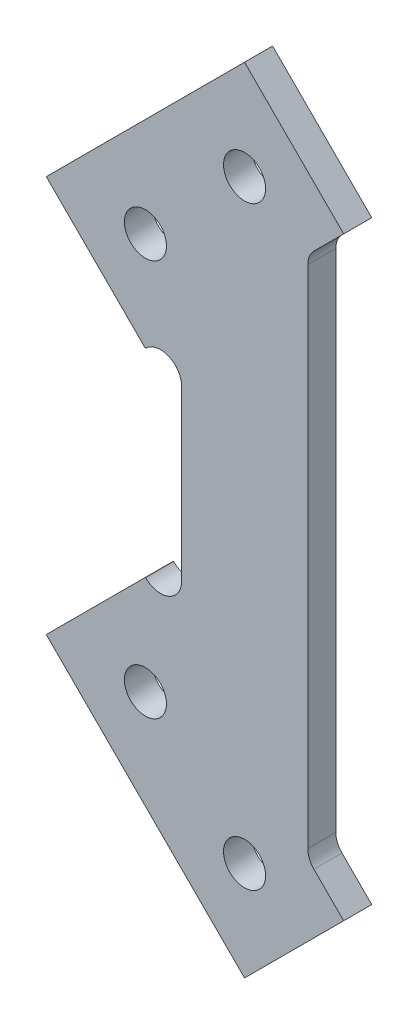
ISO-10303-21;
HEADER;
FILE_DESCRIPTION(('STEP AP214'),'2;1');
FILE_NAME('part.step','',(''),(''),'','','');
FILE_SCHEMA(('AUTOMOTIVE_DESIGN { 1 0 10303 214 1 1 1 1 }'));
ENDSEC;
DATA;
#1=APPLICATION_CONTEXT('core data for automotive mechanical design processes');
#2=APPLICATION_PROTOCOL_DEFINITION('international standard','automotive_design',2000,#1);
#3=PRODUCT_CONTEXT('',#1,'mechanical');
#4=PRODUCT('Part','Part','',(#3));
#5=PRODUCT_RELATED_PRODUCT_CATEGORY('part','',(#4));
#6=PRODUCT_DEFINITION_FORMATION('','',#4);
#7=PRODUCT_DEFINITION_CONTEXT('part definition',#1,'design');
#8=PRODUCT_DEFINITION('design','',#6,#7);
#9=PRODUCT_DEFINITION_SHAPE('','',#8);
#10=(LENGTH_UNIT() NAMED_UNIT(*) SI_UNIT(.MILLI.,.METRE.));
#11=(NAMED_UNIT(*) PLANE_ANGLE_UNIT() SI_UNIT($,.RADIAN.));
#12=(NAMED_UNIT(*) SI_UNIT($,.STERADIAN.) SOLID_ANGLE_UNIT());
#13=UNCERTAINTY_MEASURE_WITH_UNIT(LENGTH_MEASURE(1.E-05),#10,'distance_accuracy_value','');
#14=(GEOMETRIC_REPRESENTATION_CONTEXT(3) GLOBAL_UNCERTAINTY_ASSIGNED_CONTEXT((#13)) GLOBAL_UNIT_ASSIGNED_CONTEXT((#10,
#11,#12)) REPRESENTATION_CONTEXT('',''));
#15=CARTESIAN_POINT('',(0.,0.,0.));
#16=DIRECTION('',(0.,0.,1.));
#17=DIRECTION('',(1.,0.,0.));
#18=AXIS2_PLACEMENT_3D('',#15,#16,#17);
#19=CARTESIAN_POINT('',(-12.0000000000007,12.0624458405147,4.));
#20=DIRECTION('',(0.,0.,1.));
#21=DIRECTION('',(1.,0.,0.));
#22=AXIS2_PLACEMENT_3D('',#19,#20,#21);
#23=PLANE('',#22);
#24=CARTESIAN_POINT('',(-14.1629509039037,-28.2842712474611,4.));
#25=DIRECTION('',(0.,0.,1.));
#26=DIRECTION('',(1.,0.,0.));
#27=AXIS2_PLACEMENT_3D('',#24,#25,#26);
#28=CIRCLE('',#27,3.00000000000029);
#29=CARTESIAN_POINT('',(-11.1629509039034,-28.2842712474611,4.));
#30=VERTEX_POINT('',#29);
#31=EDGE_CURVE('E343',#30,#30,#28,.T.);
#32=ORIENTED_EDGE('',*,*,#31,.F.);
#33=EDGE_LOOP('',(#32));
#34=FACE_BOUND('',#33,.T.);
#35=CARTESIAN_POINT('',(-0.0208152801727197,42.4264068711936,4.));
#36=DIRECTION('',(0.,0.,1.));
#37=DIRECTION('',(1.,0.,0.));
#38=AXIS2_PLACEMENT_3D('',#35,#36,#37);
#39=CIRCLE('',#38,2.99999999999871);
#40=CARTESIAN_POINT('',(2.97918471982599,42.4264068711936,4.));
#41=VERTEX_POINT('',#40);
#42=EDGE_CURVE('E181',#41,#41,#39,.T.);
#43=ORIENTED_EDGE('',*,*,#42,.F.);
#44=EDGE_LOOP('',(#43));
#45=FACE_BOUND('',#44,.T.);
#46=DIRECTION('',(0.707106781186546,-0.707106781186549,0.));
#47=VECTOR('',#46,1.);
#48=CARTESIAN_POINT('',(-28.3050865276346,28.2842712474627,4.));
#49=LINE('',#48,#47);
#50=CARTESIAN_POINT('',(-28.3050865276346,28.2842712474627,4.));
#51=VERTEX_POINT('',#50);
#52=CARTESIAN_POINT('',(-14.1629509039037,14.1421356237317,4.));
#53=VERTEX_POINT('',#52);
#54=EDGE_CURVE('E208',#51,#53,#49,.T.);
#55=ORIENTED_EDGE('',*,*,#54,.T.);
#56=DIRECTION('',(0.7071067811864,0.707106781186695,0.));
#57=VECTOR('',#56,1.);
#58=CARTESIAN_POINT('',(-14.1629509039037,14.1421356237317,4.));
#59=LINE('',#58,#57);
#60=CARTESIAN_POINT('',(-14.1213203435611,14.1837661840744,4.));
#61=VERTEX_POINT('',#60);
#62=EDGE_CURVE('E116',#53,#61,#59,.T.);
#63=ORIENTED_EDGE('',*,*,#62,.T.);
#64=CARTESIAN_POINT('',(-12.0000000000007,12.0624458405147,4.));
#65=DIRECTION('',(0.,0.,-1.));
#66=DIRECTION('',(1.,0.,0.));
#67=AXIS2_PLACEMENT_3D('',#64,#65,#66);
#68=CIRCLE('',#67,2.99999999999989);
#69=CARTESIAN_POINT('',(-9.00000000000085,12.0624458405147,4.));
#70=VERTEX_POINT('',#69);
#71=EDGE_CURVE('E247',#61,#70,#68,.T.);
#72=ORIENTED_EDGE('',*,*,#71,.T.);
#73=DIRECTION('',(0.,-1.,0.));
#74=VECTOR('',#73,1.);
#75=CARTESIAN_POINT('',(-9.00000000000148,12.0624458405147,4.));
#76=LINE('',#75,#74);
#77=CARTESIAN_POINT('',(-9.00000000000075,-12.0624458405131,4.));
#78=VERTEX_POINT('',#77);
#79=EDGE_CURVE('E266',#70,#78,#76,.T.);
#80=ORIENTED_EDGE('',*,*,#79,.T.);
#81=CARTESIAN_POINT('',(-12.0000000000008,-12.0624458405131,4.));
#82=DIRECTION('',(0.,0.,-1.));
#83=DIRECTION('',(-1.,0.,0.));
#84=AXIS2_PLACEMENT_3D('',#81,#82,#83);
#85=CIRCLE('',#84,3.);
#86=CARTESIAN_POINT('',(-14.1213203435604,-14.1837661840727,4.));
#87=VERTEX_POINT('',#86);
#88=EDGE_CURVE('E263',#78,#87,#85,.T.);
#89=ORIENTED_EDGE('',*,*,#88,.T.);
#90=DIRECTION('',(-0.707106781186459,0.707106781186636,0.));
#91=VECTOR('',#90,1.);
#92=CARTESIAN_POINT('',(-14.162950903903,-14.1421356237301,4.));
#93=LINE('',#92,#91);
#94=CARTESIAN_POINT('',(-14.162950903903,-14.1421356237301,4.));
#95=VERTEX_POINT('',#94);
#96=EDGE_CURVE('E265',#87,#95,#93,.T.);
#97=ORIENTED_EDGE('',*,*,#96,.T.);
#98=DIRECTION('',(-0.707106781186568,-0.707106781186527,0.));
#99=VECTOR('',#98,1.);
#100=CARTESIAN_POINT('',(-28.3050865276346,-28.284271247461,4.));
#101=LINE('',#100,#99);
#102=CARTESIAN_POINT('',(-28.3050865276346,-28.284271247461,4.));
#103=VERTEX_POINT('',#102);
#104=EDGE_CURVE('E268',#95,#103,#101,.T.);
#105=ORIENTED_EDGE('',*,*,#104,.T.);
#106=DIRECTION('',(0.707106781186546,-0.707106781186549,0.));
#107=VECTOR('',#106,1.);
#108=CARTESIAN_POINT('',(-0.0208152801728197,-56.568542494923,4.));
#109=LINE('',#108,#107);
#110=CARTESIAN_POINT('',(-0.0208152801728197,-56.568542494923,4.));
#111=VERTEX_POINT('',#110);
#112=EDGE_CURVE('E274',#103,#111,#109,.T.);
#113=ORIENTED_EDGE('',*,*,#112,.T.);
#114=DIRECTION('',(0.707106781186549,0.707106781186546,0.));
#115=VECTOR('',#114,1.);
#116=CARTESIAN_POINT('',(14.1213203435582,-42.4264068711921,4.));
#117=LINE('',#116,#115);
#118=CARTESIAN_POINT('',(14.1213203435582,-42.4264068711921,4.));
#119=VERTEX_POINT('',#118);
#120=EDGE_CURVE('E276',#111,#119,#117,.T.);
#121=ORIENTED_EDGE('',*,*,#120,.T.);
#122=DIRECTION('',(-0.707106781186547,0.707106781186549,0.));
#123=VECTOR('',#122,1.);
#124=CARTESIAN_POINT('',(9.87867965643887,-38.1837661840728,4.));
#125=LINE('',#124,#123);
#126=CARTESIAN_POINT('',(9.87867965643887,-38.1837661840728,4.));
#127=VERTEX_POINT('',#126);
#128=EDGE_CURVE('E278',#119,#127,#125,.T.);
#129=ORIENTED_EDGE('',*,*,#128,.T.);
#130=CARTESIAN_POINT('',(11.9999999999993,-36.0624458405132,4.));
#131=DIRECTION('',(0.,0.,-1.));
#132=DIRECTION('',(1.,0.,0.));
#133=AXIS2_PLACEMENT_3D('',#130,#131,#132);
#134=CIRCLE('',#133,3.00000000000061);
#135=CARTESIAN_POINT('',(8.99999999999864,-36.0624458405131,4.));
#136=VERTEX_POINT('',#135);
#137=EDGE_CURVE('E280',#127,#136,#134,.T.);
#138=ORIENTED_EDGE('',*,*,#137,.T.);
#139=DIRECTION('',(0.,1.,0.));
#140=VECTOR('',#139,1.);
#141=CARTESIAN_POINT('',(8.99999999999851,36.0624458405146,4.));
#142=LINE('',#141,#140);
#143=CARTESIAN_POINT('',(8.99999999999851,36.0624458405146,4.));
#144=VERTEX_POINT('',#143);
#145=EDGE_CURVE('E282',#136,#144,#142,.T.);
#146=ORIENTED_EDGE('',*,*,#145,.T.);
#147=CARTESIAN_POINT('',(11.9999999999992,36.0624458405146,4.));
#148=DIRECTION('',(0.,0.,-1.));
#149=DIRECTION('',(1.,0.,0.));
#150=AXIS2_PLACEMENT_3D('',#147,#148,#149);
#151=CIRCLE('',#150,3.00000000000063);
#152=CARTESIAN_POINT('',(9.8786796564388,38.1837661840743,4.));
#153=VERTEX_POINT('',#152);
#154=EDGE_CURVE('E159',#144,#153,#151,.T.);
#155=ORIENTED_EDGE('',*,*,#154,.T.);
#156=DIRECTION('',(0.70710678118655,0.707106781186545,0.));
#157=VECTOR('',#156,1.);
#158=CARTESIAN_POINT('',(9.87867965643887,38.1837661840742,4.));
#159=LINE('',#158,#157);
#160=CARTESIAN_POINT('',(14.1213203435577,42.426406871193,4.));
#161=VERTEX_POINT('',#160);
#162=EDGE_CURVE('E153',#153,#161,#159,.T.);
#163=ORIENTED_EDGE('',*,*,#162,.T.);
#164=DIRECTION('',(-0.707106781186518,0.707106781186576,0.));
#165=VECTOR('',#164,1.);
#166=CARTESIAN_POINT('',(14.1213203435577,42.426406871193,4.));
#167=LINE('',#166,#165);
#168=CARTESIAN_POINT('',(-0.0208152801726905,56.5685424949245,4.));
#169=VERTEX_POINT('',#168);
#170=EDGE_CURVE('E157',#161,#169,#167,.T.);
#171=ORIENTED_EDGE('',*,*,#170,.T.);
#172=DIRECTION('',(-0.707106781186549,-0.707106781186546,0.));
#173=VECTOR('',#172,1.);
#174=CARTESIAN_POINT('',(-0.0208152801726905,56.5685424949245,4.));
#175=LINE('',#174,#173);
#176=EDGE_CURVE('E49',#169,#51,#175,.T.);
#177=ORIENTED_EDGE('',*,*,#176,.T.);
#178=EDGE_LOOP('',(#55,#63,#72,#80,#89,#97,#105,#113,#121,#129,#138,#146,#155,#163,#171,#177));
#179=FACE_BOUND('',#178,.T.);
#180=CARTESIAN_POINT('',(-14.1629509039037,28.2842712474627,4.));
#181=DIRECTION('',(0.,0.,1.));
#182=DIRECTION('',(1.,0.,0.));
#183=AXIS2_PLACEMENT_3D('',#180,#181,#182);
#184=CIRCLE('',#183,2.99999999999871);
#185=CARTESIAN_POINT('',(-11.162950903905,28.2842712474627,4.));
#186=VERTEX_POINT('',#185);
#187=EDGE_CURVE('E349',#186,#186,#184,.T.);
#188=ORIENTED_EDGE('',*,*,#187,.F.);
#189=EDGE_LOOP('',(#188));
#190=FACE_BOUND('',#189,.T.);
#191=CARTESIAN_POINT('',(-0.0208152801727912,-42.426406871192,4.));
#192=DIRECTION('',(0.,0.,1.));
#193=DIRECTION('',(1.,0.,0.));
#194=AXIS2_PLACEMENT_3D('',#191,#192,#193);
#195=CIRCLE('',#194,3.0000000000003);
#196=CARTESIAN_POINT('',(2.97918471982751,-42.426406871192,4.));
#197=VERTEX_POINT('',#196);
#198=EDGE_CURVE('E334',#197,#197,#195,.T.);
#199=ORIENTED_EDGE('',*,*,#198,.F.);
#200=EDGE_LOOP('',(#199));
#201=FACE_BOUND('',#200,.T.);
#202=ADVANCED_FACE('F32',(#34,#45,#179,#190,#201),#23,.T.);
#203=CARTESIAN_POINT('',(-12.0000000000007,12.0624458405147,0.));
#204=DIRECTION('',(0.,0.,1.));
#205=DIRECTION('',(1.,0.,0.));
#206=AXIS2_PLACEMENT_3D('',#203,#204,#205);
#207=PLANE('',#206);
#208=CARTESIAN_POINT('',(-14.1629509039037,-28.2842712474611,0.));
#209=DIRECTION('',(0.,0.,1.));
#210=DIRECTION('',(1.,0.,0.));
#211=AXIS2_PLACEMENT_3D('',#208,#209,#210);
#212=CIRCLE('',#211,3.00000000000029);
#213=CARTESIAN_POINT('',(-11.1629509039034,-28.2842712474611,0.));
#214=VERTEX_POINT('',#213);
#215=EDGE_CURVE('E340',#214,#214,#212,.T.);
#216=ORIENTED_EDGE('',*,*,#215,.T.);
#217=EDGE_LOOP('',(#216));
#218=FACE_BOUND('',#217,.T.);
#219=CARTESIAN_POINT('',(-0.0208152801727197,42.4264068711936,0.));
#220=DIRECTION('',(0.,0.,1.));
#221=DIRECTION('',(1.,0.,0.));
#222=AXIS2_PLACEMENT_3D('',#219,#220,#221);
#223=CIRCLE('',#222,2.99999999999871);
#224=CARTESIAN_POINT('',(2.97918471982599,42.4264068711936,0.));
#225=VERTEX_POINT('',#224);
#226=EDGE_CURVE('E352',#225,#225,#223,.T.);
#227=ORIENTED_EDGE('',*,*,#226,.T.);
#228=EDGE_LOOP('',(#227));
#229=FACE_BOUND('',#228,.T.);
#230=DIRECTION('',(0.707106781186546,-0.707106781186549,0.));
#231=VECTOR('',#230,1.);
#232=CARTESIAN_POINT('',(-28.3050865276346,28.2842712474627,0.));
#233=LINE('',#232,#231);
#234=CARTESIAN_POINT('',(-28.3050865276346,28.2842712474627,0.));
#235=VERTEX_POINT('',#234);
#236=CARTESIAN_POINT('',(-14.1629509039037,14.1421356237317,0.));
#237=VERTEX_POINT('',#236);
#238=EDGE_CURVE('E177',#235,#237,#233,.T.);
#239=ORIENTED_EDGE('',*,*,#238,.F.);
#240=DIRECTION('',(-0.707106781186549,-0.707106781186546,0.));
#241=VECTOR('',#240,1.);
#242=CARTESIAN_POINT('',(-0.0208152801726905,56.5685424949245,0.));
#243=LINE('',#242,#241);
#244=CARTESIAN_POINT('',(-0.0208152801726905,56.5685424949245,0.));
#245=VERTEX_POINT('',#244);
#246=EDGE_CURVE('E108',#245,#235,#243,.T.);
#247=ORIENTED_EDGE('',*,*,#246,.F.);
#248=DIRECTION('',(-0.707106781186518,0.707106781186576,0.));
#249=VECTOR('',#248,1.);
#250=CARTESIAN_POINT('',(14.1213203435577,42.426406871193,0.));
#251=LINE('',#250,#249);
#252=CARTESIAN_POINT('',(14.1213203435577,42.426406871193,0.));
#253=VERTEX_POINT('',#252);
#254=EDGE_CURVE('E102',#253,#245,#251,.T.);
#255=ORIENTED_EDGE('',*,*,#254,.F.);
#256=DIRECTION('',(0.70710678118655,0.707106781186545,0.));
#257=VECTOR('',#256,1.);
#258=CARTESIAN_POINT('',(9.87867965643887,38.1837661840742,0.));
#259=LINE('',#258,#257);
#260=CARTESIAN_POINT('',(9.8786796564388,38.1837661840743,0.));
#261=VERTEX_POINT('',#260);
#262=EDGE_CURVE('E167',#261,#253,#259,.T.);
#263=ORIENTED_EDGE('',*,*,#262,.F.);
#264=CARTESIAN_POINT('',(11.9999999999992,36.0624458405146,0.));
#265=DIRECTION('',(0.,0.,-1.));
#266=DIRECTION('',(1.,0.,0.));
#267=AXIS2_PLACEMENT_3D('',#264,#265,#266);
#268=CIRCLE('',#267,3.00000000000063);
#269=CARTESIAN_POINT('',(8.99999999999851,36.0624458405146,0.));
#270=VERTEX_POINT('',#269);
#271=EDGE_CURVE('E203',#270,#261,#268,.T.);
#272=ORIENTED_EDGE('',*,*,#271,.F.);
#273=DIRECTION('',(0.,1.,0.));
#274=VECTOR('',#273,1.);
#275=CARTESIAN_POINT('',(8.99999999999851,36.0624458405146,0.));
#276=LINE('',#275,#274);
#277=CARTESIAN_POINT('',(8.99999999999864,-36.0624458405131,0.));
#278=VERTEX_POINT('',#277);
#279=EDGE_CURVE('E201',#278,#270,#276,.T.);
#280=ORIENTED_EDGE('',*,*,#279,.F.);
#281=CARTESIAN_POINT('',(11.9999999999993,-36.0624458405132,0.));
#282=DIRECTION('',(0.,0.,-1.));
#283=DIRECTION('',(1.,0.,0.));
#284=AXIS2_PLACEMENT_3D('',#281,#282,#283);
#285=CIRCLE('',#284,3.00000000000061);
#286=CARTESIAN_POINT('',(9.87867965643887,-38.1837661840728,0.));
#287=VERTEX_POINT('',#286);
#288=EDGE_CURVE('E199',#287,#278,#285,.T.);
#289=ORIENTED_EDGE('',*,*,#288,.F.);
#290=DIRECTION('',(-0.707106781186547,0.707106781186549,0.));
#291=VECTOR('',#290,1.);
#292=CARTESIAN_POINT('',(9.87867965643887,-38.1837661840728,0.));
#293=LINE('',#292,#291);
#294=CARTESIAN_POINT('',(14.1213203435582,-42.4264068711921,0.));
#295=VERTEX_POINT('',#294);
#296=EDGE_CURVE('E197',#295,#287,#293,.T.);
#297=ORIENTED_EDGE('',*,*,#296,.F.);
#298=DIRECTION('',(0.707106781186549,0.707106781186546,0.));
#299=VECTOR('',#298,1.);
#300=CARTESIAN_POINT('',(14.1213203435582,-42.4264068711921,0.));
#301=LINE('',#300,#299);
#302=CARTESIAN_POINT('',(-0.0208152801728197,-56.568542494923,0.));
#303=VERTEX_POINT('',#302);
#304=EDGE_CURVE('E195',#303,#295,#301,.T.);
#305=ORIENTED_EDGE('',*,*,#304,.F.);
#306=DIRECTION('',(0.707106781186546,-0.707106781186549,0.));
#307=VECTOR('',#306,1.);
#308=CARTESIAN_POINT('',(-0.0208152801728197,-56.568542494923,0.));
#309=LINE('',#308,#307);
#310=CARTESIAN_POINT('',(-28.3050865276346,-28.284271247461,0.));
#311=VERTEX_POINT('',#310);
#312=EDGE_CURVE('E193',#311,#303,#309,.T.);
#313=ORIENTED_EDGE('',*,*,#312,.F.);
#314=DIRECTION('',(-0.707106781186568,-0.707106781186527,0.));
#315=VECTOR('',#314,1.);
#316=CARTESIAN_POINT('',(-28.3050865276346,-28.284271247461,0.));
#317=LINE('',#316,#315);
#318=CARTESIAN_POINT('',(-14.162950903903,-14.1421356237301,0.));
#319=VERTEX_POINT('',#318);
#320=EDGE_CURVE('E191',#319,#311,#317,.T.);
#321=ORIENTED_EDGE('',*,*,#320,.F.);
#322=DIRECTION('',(-0.707106781186459,0.707106781186636,0.));
#323=VECTOR('',#322,1.);
#324=CARTESIAN_POINT('',(-14.162950903903,-14.1421356237301,0.));
#325=LINE('',#324,#323);
#326=CARTESIAN_POINT('',(-14.1213203435604,-14.1837661840727,0.));
#327=VERTEX_POINT('',#326);
#328=EDGE_CURVE('E189',#327,#319,#325,.T.);
#329=ORIENTED_EDGE('',*,*,#328,.F.);
#330=CARTESIAN_POINT('',(-12.0000000000008,-12.0624458405131,0.));
#331=DIRECTION('',(0.,0.,-1.));
#332=DIRECTION('',(-1.,0.,0.));
#333=AXIS2_PLACEMENT_3D('',#330,#331,#332);
#334=CIRCLE('',#333,3.);
#335=CARTESIAN_POINT('',(-9.00000000000075,-12.0624458405131,0.));
#336=VERTEX_POINT('',#335);
#337=EDGE_CURVE('E187',#336,#327,#334,.T.);
#338=ORIENTED_EDGE('',*,*,#337,.F.);
#339=DIRECTION('',(0.,-1.,0.));
#340=VECTOR('',#339,1.);
#341=CARTESIAN_POINT('',(-9.00000000000148,12.0624458405147,0.));
#342=LINE('',#341,#340);
#343=CARTESIAN_POINT('',(-9.00000000000085,12.0624458405147,0.));
#344=VERTEX_POINT('',#343);
#345=EDGE_CURVE('E185',#344,#336,#342,.T.);
#346=ORIENTED_EDGE('',*,*,#345,.F.);
#347=CARTESIAN_POINT('',(-12.0000000000007,12.0624458405147,0.));
#348=DIRECTION('',(0.,0.,-1.));
#349=DIRECTION('',(1.,0.,0.));
#350=AXIS2_PLACEMENT_3D('',#347,#348,#349);
#351=CIRCLE('',#350,2.99999999999989);
#352=CARTESIAN_POINT('',(-14.1213203435611,14.1837661840744,0.));
#353=VERTEX_POINT('',#352);
#354=EDGE_CURVE('E183',#353,#344,#351,.T.);
#355=ORIENTED_EDGE('',*,*,#354,.F.);
#356=DIRECTION('',(0.7071067811864,0.707106781186695,0.));
#357=VECTOR('',#356,1.);
#358=CARTESIAN_POINT('',(-14.1629509039037,14.1421356237317,0.));
#359=LINE('',#358,#357);
#360=EDGE_CURVE('E180',#237,#353,#359,.T.);
#361=ORIENTED_EDGE('',*,*,#360,.F.);
#362=EDGE_LOOP('',(#239,#247,#255,#263,#272,#280,#289,#297,#305,#313,#321,#329,#338,#346,#355,#361));
#363=FACE_BOUND('',#362,.T.);
#364=CARTESIAN_POINT('',(-14.1629509039037,28.2842712474627,0.));
#365=DIRECTION('',(0.,0.,1.));
#366=DIRECTION('',(1.,0.,0.));
#367=AXIS2_PLACEMENT_3D('',#364,#365,#366);
#368=CIRCLE('',#367,2.99999999999871);
#369=CARTESIAN_POINT('',(-11.162950903905,28.2842712474627,0.));
#370=VERTEX_POINT('',#369);
#371=EDGE_CURVE('E346',#370,#370,#368,.T.);
#372=ORIENTED_EDGE('',*,*,#371,.T.);
#373=EDGE_LOOP('',(#372));
#374=FACE_BOUND('',#373,.T.);
#375=CARTESIAN_POINT('',(-0.0208152801727912,-42.426406871192,0.));
#376=DIRECTION('',(0.,0.,1.));
#377=DIRECTION('',(1.,0.,0.));
#378=AXIS2_PLACEMENT_3D('',#375,#376,#377);
#379=CIRCLE('',#378,3.0000000000003);
#380=CARTESIAN_POINT('',(2.97918471982751,-42.426406871192,0.));
#381=VERTEX_POINT('',#380);
#382=EDGE_CURVE('E337',#381,#381,#379,.T.);
#383=ORIENTED_EDGE('',*,*,#382,.T.);
#384=EDGE_LOOP('',(#383));
#385=FACE_BOUND('',#384,.T.);
#386=ADVANCED_FACE('F251',(#218,#229,#363,#374,#385),#207,.F.);
#387=CARTESIAN_POINT('',(-28.3050865276346,28.2842712474627,4.));
#388=DIRECTION('',(0.707106781186549,0.707106781186546,0.));
#389=DIRECTION('',(-0.707106781186546,0.707106781186549,0.));
#390=AXIS2_PLACEMENT_3D('',#387,#388,#389);
#391=PLANE('',#390);
#392=ORIENTED_EDGE('',*,*,#238,.T.);
#393=DIRECTION('',(0.,0.,-1.));
#394=VECTOR('',#393,1.);
#395=CARTESIAN_POINT('',(-14.1629509039037,14.1421356237317,4.));
#396=LINE('',#395,#394);
#397=EDGE_CURVE('E11',#53,#237,#396,.T.);
#398=ORIENTED_EDGE('',*,*,#397,.F.);
#399=ORIENTED_EDGE('',*,*,#54,.F.);
#400=DIRECTION('',(0.,0.,-1.));
#401=VECTOR('',#400,1.);
#402=CARTESIAN_POINT('',(-28.3050865276346,28.2842712474627,4.));
#403=LINE('',#402,#401);
#404=EDGE_CURVE('E173',#51,#235,#403,.T.);
#405=ORIENTED_EDGE('',*,*,#404,.T.);
#406=EDGE_LOOP('',(#392,#398,#399,#405));
#407=FACE_BOUND('',#406,.T.);
#408=ADVANCED_FACE('F34',(#407),#391,.F.);
#409=CARTESIAN_POINT('',(-14.1629509039037,14.1421356237317,4.));
#410=DIRECTION('',(-0.707106781186695,0.7071067811864,0.));
#411=DIRECTION('',(-0.7071067811864,-0.707106781186695,0.));
#412=AXIS2_PLACEMENT_3D('',#409,#410,#411);
#413=PLANE('',#412);
#414=ORIENTED_EDGE('',*,*,#360,.T.);
#415=DIRECTION('',(0.,0.,-1.));
#416=VECTOR('',#415,1.);
#417=CARTESIAN_POINT('',(-14.1213203435611,14.1837661840744,4.));
#418=LINE('',#417,#416);
#419=EDGE_CURVE('E41',#61,#353,#418,.T.);
#420=ORIENTED_EDGE('',*,*,#419,.F.);
#421=ORIENTED_EDGE('',*,*,#62,.F.);
#422=ORIENTED_EDGE('',*,*,#397,.T.);
#423=EDGE_LOOP('',(#414,#420,#421,#422));
#424=FACE_BOUND('',#423,.T.);
#425=ADVANCED_FACE('F501',(#424),#413,.F.);
#426=CARTESIAN_POINT('',(-12.0000000000007,12.0624458405147,4.));
#427=DIRECTION('',(0.,0.,-1.));
#428=DIRECTION('',(-1.,0.,0.));
#429=AXIS2_PLACEMENT_3D('',#426,#427,#428);
#430=CYLINDRICAL_SURFACE('',#429,2.99999999999989);
#431=ORIENTED_EDGE('',*,*,#354,.T.);
#432=DIRECTION('',(0.,0.,-1.));
#433=VECTOR('',#432,1.);
#434=CARTESIAN_POINT('',(-9.00000000000085,12.0624458405147,4.));
#435=LINE('',#434,#433);
#436=EDGE_CURVE('E239',#70,#344,#435,.T.);
#437=ORIENTED_EDGE('',*,*,#436,.F.);
#438=ORIENTED_EDGE('',*,*,#71,.F.);
#439=ORIENTED_EDGE('',*,*,#419,.T.);
#440=EDGE_LOOP('',(#431,#437,#438,#439));
#441=FACE_BOUND('',#440,.T.);
#442=ADVANCED_FACE('F245',(#441),#430,.F.);
#443=CARTESIAN_POINT('',(-9.00000000000148,12.0624458405147,4.));
#444=DIRECTION('',(1.,0.,0.));
#445=DIRECTION('',(0.,1.,0.));
#446=AXIS2_PLACEMENT_3D('',#443,#444,#445);
#447=PLANE('',#446);
#448=ORIENTED_EDGE('',*,*,#345,.T.);
#449=DIRECTION('',(0.,0.,-1.));
#450=VECTOR('',#449,1.);
#451=CARTESIAN_POINT('',(-9.00000000000075,-12.0624458405131,4.));
#452=LINE('',#451,#450);
#453=EDGE_CURVE('E236',#78,#336,#452,.T.);
#454=ORIENTED_EDGE('',*,*,#453,.F.);
#455=ORIENTED_EDGE('',*,*,#79,.F.);
#456=ORIENTED_EDGE('',*,*,#436,.T.);
#457=EDGE_LOOP('',(#448,#454,#455,#456));
#458=FACE_BOUND('',#457,.T.);
#459=ADVANCED_FACE('F257',(#458),#447,.F.);
#460=CARTESIAN_POINT('',(-12.0000000000008,-12.0624458405131,4.));
#461=DIRECTION('',(0.,0.,-1.));
#462=DIRECTION('',(-1.,0.,0.));
#463=AXIS2_PLACEMENT_3D('',#460,#461,#462);
#464=CYLINDRICAL_SURFACE('',#463,3.);
#465=ORIENTED_EDGE('',*,*,#337,.T.);
#466=DIRECTION('',(0.,0.,-1.));
#467=VECTOR('',#466,1.);
#468=CARTESIAN_POINT('',(-14.1213203435604,-14.1837661840727,4.));
#469=LINE('',#468,#467);
#470=EDGE_CURVE('E233',#87,#327,#469,.T.);
#471=ORIENTED_EDGE('',*,*,#470,.F.);
#472=ORIENTED_EDGE('',*,*,#88,.F.);
#473=ORIENTED_EDGE('',*,*,#453,.T.);
#474=EDGE_LOOP('',(#465,#471,#472,#473));
#475=FACE_BOUND('',#474,.T.);
#476=ADVANCED_FACE('F261',(#475),#464,.F.);
#477=CARTESIAN_POINT('',(-14.162950903903,-14.1421356237301,4.));
#478=DIRECTION('',(-0.707106781186636,-0.707106781186459,0.));
#479=DIRECTION('',(0.707106781186459,-0.707106781186636,0.));
#480=AXIS2_PLACEMENT_3D('',#477,#478,#479);
#481=PLANE('',#480);
#482=ORIENTED_EDGE('',*,*,#328,.T.);
#483=DIRECTION('',(0.,0.,-1.));
#484=VECTOR('',#483,1.);
#485=CARTESIAN_POINT('',(-14.162950903903,-14.1421356237301,4.));
#486=LINE('',#485,#484);
#487=EDGE_CURVE('E230',#95,#319,#486,.T.);
#488=ORIENTED_EDGE('',*,*,#487,.F.);
#489=ORIENTED_EDGE('',*,*,#96,.F.);
#490=ORIENTED_EDGE('',*,*,#470,.T.);
#491=EDGE_LOOP('',(#482,#488,#489,#490));
#492=FACE_BOUND('',#491,.T.);
#493=ADVANCED_FACE('F466',(#492),#481,.F.);
#494=CARTESIAN_POINT('',(-28.3050865276346,-28.284271247461,4.));
#495=DIRECTION('',(0.707106781186527,-0.707106781186568,0.));
#496=DIRECTION('',(0.707106781186568,0.707106781186527,0.));
#497=AXIS2_PLACEMENT_3D('',#494,#495,#496);
#498=PLANE('',#497);
#499=ORIENTED_EDGE('',*,*,#320,.T.);
#500=DIRECTION('',(0.,0.,-1.));
#501=VECTOR('',#500,1.);
#502=CARTESIAN_POINT('',(-28.3050865276346,-28.284271247461,4.));
#503=LINE('',#502,#501);
#504=EDGE_CURVE('E227',#103,#311,#503,.T.);
#505=ORIENTED_EDGE('',*,*,#504,.F.);
#506=ORIENTED_EDGE('',*,*,#104,.F.);
#507=ORIENTED_EDGE('',*,*,#487,.T.);
#508=EDGE_LOOP('',(#499,#505,#506,#507));
#509=FACE_BOUND('',#508,.T.);
#510=ADVANCED_FACE('F456',(#509),#498,.F.);
#511=CARTESIAN_POINT('',(-0.0208152801728197,-56.568542494923,4.));
#512=DIRECTION('',(0.707106781186549,0.707106781186546,0.));
#513=DIRECTION('',(-0.707106781186546,0.707106781186549,0.));
#514=AXIS2_PLACEMENT_3D('',#511,#512,#513);
#515=PLANE('',#514);
#516=ORIENTED_EDGE('',*,*,#312,.T.);
#517=DIRECTION('',(0.,0.,-1.));
#518=VECTOR('',#517,1.);
#519=CARTESIAN_POINT('',(-0.0208152801728197,-56.568542494923,4.));
#520=LINE('',#519,#518);
#521=EDGE_CURVE('E224',#111,#303,#520,.T.);
#522=ORIENTED_EDGE('',*,*,#521,.F.);
#523=ORIENTED_EDGE('',*,*,#112,.F.);
#524=ORIENTED_EDGE('',*,*,#504,.T.);
#525=EDGE_LOOP('',(#516,#522,#523,#524));
#526=FACE_BOUND('',#525,.T.);
#527=ADVANCED_FACE('F446',(#526),#515,.F.);
#528=CARTESIAN_POINT('',(14.1213203435582,-42.4264068711921,4.));
#529=DIRECTION('',(-0.707106781186546,0.707106781186549,0.));
#530=DIRECTION('',(-0.707106781186549,-0.707106781186546,0.));
#531=AXIS2_PLACEMENT_3D('',#528,#529,#530);
#532=PLANE('',#531);
#533=ORIENTED_EDGE('',*,*,#304,.T.);
#534=DIRECTION('',(0.,0.,-1.));
#535=VECTOR('',#534,1.);
#536=CARTESIAN_POINT('',(14.1213203435582,-42.4264068711921,4.));
#537=LINE('',#536,#535);
#538=EDGE_CURVE('E221',#119,#295,#537,.T.);
#539=ORIENTED_EDGE('',*,*,#538,.F.);
#540=ORIENTED_EDGE('',*,*,#120,.F.);
#541=ORIENTED_EDGE('',*,*,#521,.T.);
#542=EDGE_LOOP('',(#533,#539,#540,#541));
#543=FACE_BOUND('',#542,.T.);
#544=ADVANCED_FACE('F436',(#543),#532,.F.);
#545=CARTESIAN_POINT('',(9.87867965643887,-38.1837661840728,4.));
#546=DIRECTION('',(-0.707106781186549,-0.707106781186547,0.));
#547=DIRECTION('',(0.707106781186547,-0.707106781186549,0.));
#548=AXIS2_PLACEMENT_3D('',#545,#546,#547);
#549=PLANE('',#548);
#550=ORIENTED_EDGE('',*,*,#296,.T.);
#551=DIRECTION('',(0.,0.,-1.));
#552=VECTOR('',#551,1.);
#553=CARTESIAN_POINT('',(9.87867965643887,-38.1837661840728,4.));
#554=LINE('',#553,#552);
#555=EDGE_CURVE('E218',#127,#287,#554,.T.);
#556=ORIENTED_EDGE('',*,*,#555,.F.);
#557=ORIENTED_EDGE('',*,*,#128,.F.);
#558=ORIENTED_EDGE('',*,*,#538,.T.);
#559=EDGE_LOOP('',(#550,#556,#557,#558));
#560=FACE_BOUND('',#559,.T.);
#561=ADVANCED_FACE('F426',(#560),#549,.F.);
#562=CARTESIAN_POINT('',(11.9999999999993,-36.0624458405132,4.));
#563=DIRECTION('',(0.,0.,-1.));
#564=DIRECTION('',(-1.,0.,0.));
#565=AXIS2_PLACEMENT_3D('',#562,#563,#564);
#566=CYLINDRICAL_SURFACE('',#565,3.00000000000061);
#567=ORIENTED_EDGE('',*,*,#288,.T.);
#568=DIRECTION('',(0.,0.,-1.));
#569=VECTOR('',#568,1.);
#570=CARTESIAN_POINT('',(8.99999999999864,-36.0624458405131,4.));
#571=LINE('',#570,#569);
#572=EDGE_CURVE('E215',#136,#278,#571,.T.);
#573=ORIENTED_EDGE('',*,*,#572,.F.);
#574=ORIENTED_EDGE('',*,*,#137,.F.);
#575=ORIENTED_EDGE('',*,*,#555,.T.);
#576=EDGE_LOOP('',(#567,#573,#574,#575));
#577=FACE_BOUND('',#576,.T.);
#578=ADVANCED_FACE('F417',(#577),#566,.F.);
#579=CARTESIAN_POINT('',(8.99999999999851,36.0624458405146,4.));
#580=DIRECTION('',(-1.,0.,0.));
#581=DIRECTION('',(0.,-1.,0.));
#582=AXIS2_PLACEMENT_3D('',#579,#580,#581);
#583=PLANE('',#582);
#584=ORIENTED_EDGE('',*,*,#279,.T.);
#585=DIRECTION('',(0.,0.,-1.));
#586=VECTOR('',#585,1.);
#587=CARTESIAN_POINT('',(8.99999999999851,36.0624458405146,4.));
#588=LINE('',#587,#586);
#589=EDGE_CURVE('E212',#144,#270,#588,.T.);
#590=ORIENTED_EDGE('',*,*,#589,.F.);
#591=ORIENTED_EDGE('',*,*,#145,.F.);
#592=ORIENTED_EDGE('',*,*,#572,.T.);
#593=EDGE_LOOP('',(#584,#590,#591,#592));
#594=FACE_BOUND('',#593,.T.);
#595=ADVANCED_FACE('F288',(#594),#583,.F.);
#596=CARTESIAN_POINT('',(11.9999999999992,36.0624458405146,4.));
#597=DIRECTION('',(0.,0.,-1.));
#598=DIRECTION('',(-1.,0.,0.));
#599=AXIS2_PLACEMENT_3D('',#596,#597,#598);
#600=CYLINDRICAL_SURFACE('',#599,3.00000000000063);
#601=ORIENTED_EDGE('',*,*,#271,.T.);
#602=DIRECTION('',(0.,0.,-1.));
#603=VECTOR('',#602,1.);
#604=CARTESIAN_POINT('',(9.8786796564388,38.1837661840743,4.));
#605=LINE('',#604,#603);
#606=EDGE_CURVE('E168',#153,#261,#605,.T.);
#607=ORIENTED_EDGE('',*,*,#606,.F.);
#608=ORIENTED_EDGE('',*,*,#154,.F.);
#609=ORIENTED_EDGE('',*,*,#589,.T.);
#610=EDGE_LOOP('',(#601,#607,#608,#609));
#611=FACE_BOUND('',#610,.T.);
#612=ADVANCED_FACE('F292',(#611),#600,.F.);
#613=CARTESIAN_POINT('',(9.87867965643887,38.1837661840742,4.));
#614=DIRECTION('',(-0.707106781186545,0.70710678118655,0.));
#615=DIRECTION('',(-0.70710678118655,-0.707106781186545,0.));
#616=AXIS2_PLACEMENT_3D('',#613,#614,#615);
#617=PLANE('',#616);
#618=ORIENTED_EDGE('',*,*,#262,.T.);
#619=DIRECTION('',(0.,0.,-1.));
#620=VECTOR('',#619,1.);
#621=CARTESIAN_POINT('',(14.1213203435577,42.426406871193,4.));
#622=LINE('',#621,#620);
#623=EDGE_CURVE('E164',#161,#253,#622,.T.);
#624=ORIENTED_EDGE('',*,*,#623,.F.);
#625=ORIENTED_EDGE('',*,*,#162,.F.);
#626=ORIENTED_EDGE('',*,*,#606,.T.);
#627=EDGE_LOOP('',(#618,#624,#625,#626));
#628=FACE_BOUND('',#627,.T.);
#629=ADVANCED_FACE('F165',(#628),#617,.F.);
#630=CARTESIAN_POINT('',(14.1213203435577,42.426406871193,4.));
#631=DIRECTION('',(-0.707106781186577,-0.707106781186519,0.));
#632=DIRECTION('',(0.707106781186519,-0.707106781186577,0.));
#633=AXIS2_PLACEMENT_3D('',#630,#631,#632);
#634=PLANE('',#633);
#635=ORIENTED_EDGE('',*,*,#254,.T.);
#636=DIRECTION('',(0.,0.,-1.));
#637=VECTOR('',#636,1.);
#638=CARTESIAN_POINT('',(-0.0208152801726905,56.5685424949245,4.));
#639=LINE('',#638,#637);
#640=EDGE_CURVE('E169',#169,#245,#639,.T.);
#641=ORIENTED_EDGE('',*,*,#640,.F.);
#642=ORIENTED_EDGE('',*,*,#170,.F.);
#643=ORIENTED_EDGE('',*,*,#623,.T.);
#644=EDGE_LOOP('',(#635,#641,#642,#643));
#645=FACE_BOUND('',#644,.T.);
#646=ADVANCED_FACE('F171',(#645),#634,.F.);
#647=CARTESIAN_POINT('',(-0.0208152801726905,56.5685424949245,4.));
#648=DIRECTION('',(0.707106781186546,-0.707106781186549,0.));
#649=DIRECTION('',(0.707106781186549,0.707106781186546,0.));
#650=AXIS2_PLACEMENT_3D('',#647,#648,#649);
#651=PLANE('',#650);
#652=ORIENTED_EDGE('',*,*,#246,.T.);
#653=ORIENTED_EDGE('',*,*,#404,.F.);
#654=ORIENTED_EDGE('',*,*,#176,.F.);
#655=ORIENTED_EDGE('',*,*,#640,.T.);
#656=EDGE_LOOP('',(#652,#653,#654,#655));
#657=FACE_BOUND('',#656,.T.);
#658=ADVANCED_FACE('F296',(#657),#651,.F.);
#659=CARTESIAN_POINT('',(-0.0208152801727197,42.4264068711936,4.));
#660=DIRECTION('',(0.,0.,-1.));
#661=DIRECTION('',(-1.,0.,0.));
#662=AXIS2_PLACEMENT_3D('',#659,#660,#661);
#663=CYLINDRICAL_SURFACE('',#662,2.99999999999871);
#664=ORIENTED_EDGE('',*,*,#42,.T.);
#665=EDGE_LOOP('',(#664));
#666=FACE_BOUND('',#665,.T.);
#667=ORIENTED_EDGE('',*,*,#226,.F.);
#668=EDGE_LOOP('',(#667));
#669=FACE_BOUND('',#668,.T.);
#670=ADVANCED_FACE('F298',(#666,#669),#663,.F.);
#671=CARTESIAN_POINT('',(-14.1629509039037,28.2842712474627,4.));
#672=DIRECTION('',(0.,0.,-1.));
#673=DIRECTION('',(-1.,0.,0.));
#674=AXIS2_PLACEMENT_3D('',#671,#672,#673);
#675=CYLINDRICAL_SURFACE('',#674,2.99999999999871);
#676=ORIENTED_EDGE('',*,*,#187,.T.);
#677=EDGE_LOOP('',(#676));
#678=FACE_BOUND('',#677,.T.);
#679=ORIENTED_EDGE('',*,*,#371,.F.);
#680=EDGE_LOOP('',(#679));
#681=FACE_BOUND('',#680,.T.);
#682=ADVANCED_FACE('F304',(#678,#681),#675,.F.);
#683=CARTESIAN_POINT('',(-14.1629509039037,-28.2842712474611,4.));
#684=DIRECTION('',(0.,0.,-1.));
#685=DIRECTION('',(-1.,0.,0.));
#686=AXIS2_PLACEMENT_3D('',#683,#684,#685);
#687=CYLINDRICAL_SURFACE('',#686,3.00000000000029);
#688=ORIENTED_EDGE('',*,*,#31,.T.);
#689=EDGE_LOOP('',(#688));
#690=FACE_BOUND('',#689,.T.);
#691=ORIENTED_EDGE('',*,*,#215,.F.);
#692=EDGE_LOOP('',(#691));
#693=FACE_BOUND('',#692,.T.);
#694=ADVANCED_FACE('F321',(#690,#693),#687,.F.);
#695=CARTESIAN_POINT('',(-0.0208152801727912,-42.426406871192,4.));
#696=DIRECTION('',(0.,0.,-1.));
#697=DIRECTION('',(-1.,0.,0.));
#698=AXIS2_PLACEMENT_3D('',#695,#696,#697);
#699=CYLINDRICAL_SURFACE('',#698,3.0000000000003);
#700=ORIENTED_EDGE('',*,*,#198,.T.);
#701=EDGE_LOOP('',(#700));
#702=FACE_BOUND('',#701,.T.);
#703=ORIENTED_EDGE('',*,*,#382,.F.);
#704=EDGE_LOOP('',(#703));
#705=FACE_BOUND('',#704,.T.);
#706=ADVANCED_FACE('F325',(#702,#705),#699,.F.);
#707=CLOSED_SHELL('',(#202,#386,#408,#425,#442,#459,#476,#493,#510,#527,#544,#561,#578,#595,
#612,#629,#646,#658,#670,#682,#694,#706));
#708=MANIFOLD_SOLID_BREP('B2',#707);
#709=ADVANCED_BREP_SHAPE_REPRESENTATION('',(#18,#708),#14);
#710=SHAPE_DEFINITION_REPRESENTATION(#9,#709);
ENDSEC;
END-ISO-10303-21;
